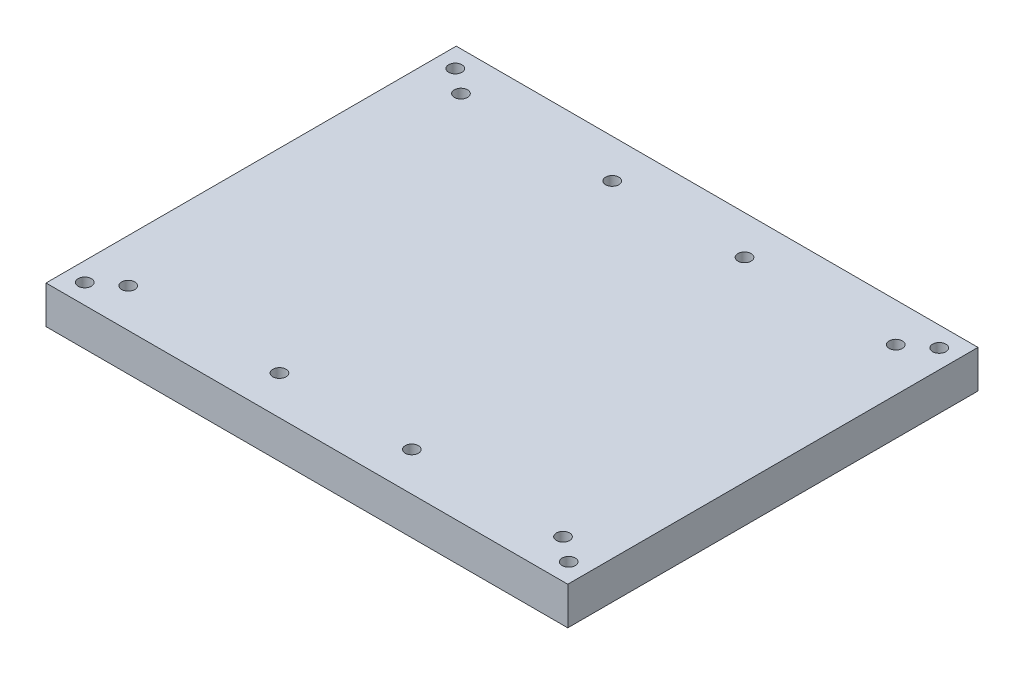
ISO-10303-21;
HEADER;
FILE_DESCRIPTION(('STEP AP214'),'2;1');
FILE_NAME('part.step','',(''),(''),'','','');
FILE_SCHEMA(('AUTOMOTIVE_DESIGN { 1 0 10303 214 1 1 1 1 }'));
ENDSEC;
DATA;
#1=APPLICATION_CONTEXT('core data for automotive mechanical design processes');
#2=APPLICATION_PROTOCOL_DEFINITION('international standard','automotive_design',2000,#1);
#3=PRODUCT_CONTEXT('',#1,'mechanical');
#4=PRODUCT('Part','Part','',(#3));
#5=PRODUCT_RELATED_PRODUCT_CATEGORY('part','',(#4));
#6=PRODUCT_DEFINITION_FORMATION('','',#4);
#7=PRODUCT_DEFINITION_CONTEXT('part definition',#1,'design');
#8=PRODUCT_DEFINITION('design','',#6,#7);
#9=PRODUCT_DEFINITION_SHAPE('','',#8);
#10=(LENGTH_UNIT() NAMED_UNIT(*) SI_UNIT(.MILLI.,.METRE.));
#11=(NAMED_UNIT(*) PLANE_ANGLE_UNIT() SI_UNIT($,.RADIAN.));
#12=(NAMED_UNIT(*) SI_UNIT($,.STERADIAN.) SOLID_ANGLE_UNIT());
#13=UNCERTAINTY_MEASURE_WITH_UNIT(LENGTH_MEASURE(1.E-05),#10,'distance_accuracy_value','');
#14=(GEOMETRIC_REPRESENTATION_CONTEXT(3) GLOBAL_UNCERTAINTY_ASSIGNED_CONTEXT((#13)) GLOBAL_UNIT_ASSIGNED_CONTEXT((#10,
#11,#12)) REPRESENTATION_CONTEXT('',''));
#15=CARTESIAN_POINT('',(0.,0.,0.));
#16=DIRECTION('',(0.,0.,1.));
#17=DIRECTION('',(1.,0.,0.));
#18=AXIS2_PLACEMENT_3D('',#15,#16,#17);
#19=CARTESIAN_POINT('',(0.,10.,0.));
#20=DIRECTION('',(0.,1.,0.));
#21=DIRECTION('',(0.,0.,1.));
#22=AXIS2_PLACEMENT_3D('',#19,#20,#21);
#23=PLANE('',#22);
#24=CARTESIAN_POINT('',(57.5,10.,-44.));
#25=DIRECTION('',(0.,1.,0.));
#26=DIRECTION('',(0.,0.,1.));
#27=AXIS2_PLACEMENT_3D('',#24,#25,#26);
#28=CIRCLE('',#27,1.75);
#29=CARTESIAN_POINT('',(57.5,10.,-42.25));
#30=VERTEX_POINT('',#29);
#31=EDGE_CURVE('E169',#30,#30,#28,.T.);
#32=ORIENTED_EDGE('',*,*,#31,.F.);
#33=EDGE_LOOP('',(#32));
#34=FACE_BOUND('',#33,.T.);
#35=CARTESIAN_POINT('',(17.5,10.,44.));
#36=DIRECTION('',(0.,1.,0.));
#37=DIRECTION('',(0.,0.,1.));
#38=AXIS2_PLACEMENT_3D('',#35,#36,#37);
#39=CIRCLE('',#38,1.75);
#40=CARTESIAN_POINT('',(17.5,10.,45.75));
#41=VERTEX_POINT('',#40);
#42=EDGE_CURVE('E157',#41,#41,#39,.T.);
#43=ORIENTED_EDGE('',*,*,#42,.F.);
#44=EDGE_LOOP('',(#43));
#45=FACE_BOUND('',#44,.T.);
#46=CARTESIAN_POINT('',(-17.5,10.,44.));
#47=DIRECTION('',(0.,1.,0.));
#48=DIRECTION('',(0.,0.,1.));
#49=AXIS2_PLACEMENT_3D('',#46,#47,#48);
#50=CIRCLE('',#49,1.75);
#51=CARTESIAN_POINT('',(-17.5,10.,45.75));
#52=VERTEX_POINT('',#51);
#53=EDGE_CURVE('E145',#52,#52,#50,.T.);
#54=ORIENTED_EDGE('',*,*,#53,.F.);
#55=EDGE_LOOP('',(#54));
#56=FACE_BOUND('',#55,.T.);
#57=CARTESIAN_POINT('',(-57.5,10.,-44.));
#58=DIRECTION('',(0.,1.,0.));
#59=DIRECTION('',(0.,0.,1.));
#60=AXIS2_PLACEMENT_3D('',#57,#58,#59);
#61=CIRCLE('',#60,1.75);
#62=CARTESIAN_POINT('',(-57.5,10.,-42.25));
#63=VERTEX_POINT('',#62);
#64=EDGE_CURVE('E133',#63,#63,#61,.T.);
#65=ORIENTED_EDGE('',*,*,#64,.F.);
#66=EDGE_LOOP('',(#65));
#67=FACE_BOUND('',#66,.T.);
#68=CARTESIAN_POINT('',(64.,10.,49.));
#69=DIRECTION('',(0.,1.,0.));
#70=DIRECTION('',(0.,0.,1.));
#71=AXIS2_PLACEMENT_3D('',#68,#69,#70);
#72=CIRCLE('',#71,1.75);
#73=CARTESIAN_POINT('',(64.,10.,50.75));
#74=VERTEX_POINT('',#73);
#75=EDGE_CURVE('E121',#74,#74,#72,.T.);
#76=ORIENTED_EDGE('',*,*,#75,.F.);
#77=EDGE_LOOP('',(#76));
#78=FACE_BOUND('',#77,.T.);
#79=CARTESIAN_POINT('',(-64.,10.,-49.));
#80=DIRECTION('',(0.,1.,0.));
#81=DIRECTION('',(0.,0.,1.));
#82=AXIS2_PLACEMENT_3D('',#79,#80,#81);
#83=CIRCLE('',#82,1.75);
#84=CARTESIAN_POINT('',(-64.,10.,-47.25));
#85=VERTEX_POINT('',#84);
#86=EDGE_CURVE('E100',#85,#85,#83,.T.);
#87=ORIENTED_EDGE('',*,*,#86,.F.);
#88=EDGE_LOOP('',(#87));
#89=FACE_BOUND('',#88,.T.);
#90=DIRECTION('',(0.,0.,1.));
#91=VECTOR('',#90,1.);
#92=CARTESIAN_POINT('',(-69.,10.,54.25));
#93=LINE('',#92,#91);
#94=CARTESIAN_POINT('',(-69.,10.,-54.25));
#95=VERTEX_POINT('',#94);
#96=CARTESIAN_POINT('',(-69.,10.,54.25));
#97=VERTEX_POINT('',#96);
#98=EDGE_CURVE('E85',#95,#97,#93,.T.);
#99=ORIENTED_EDGE('',*,*,#98,.T.);
#100=DIRECTION('',(1.,0.,0.));
#101=VECTOR('',#100,1.);
#102=CARTESIAN_POINT('',(69.,10.,54.25));
#103=LINE('',#102,#101);
#104=CARTESIAN_POINT('',(69.,10.,54.25));
#105=VERTEX_POINT('',#104);
#106=EDGE_CURVE('E80',#97,#105,#103,.T.);
#107=ORIENTED_EDGE('',*,*,#106,.T.);
#108=DIRECTION('',(0.,0.,-1.));
#109=VECTOR('',#108,1.);
#110=CARTESIAN_POINT('',(69.,10.,54.25));
#111=LINE('',#110,#109);
#112=CARTESIAN_POINT('',(69.,10.,-54.25));
#113=VERTEX_POINT('',#112);
#114=EDGE_CURVE('E83',#105,#113,#111,.T.);
#115=ORIENTED_EDGE('',*,*,#114,.T.);
#116=DIRECTION('',(-1.,0.,0.));
#117=VECTOR('',#116,1.);
#118=CARTESIAN_POINT('',(69.,10.,-54.25));
#119=LINE('',#118,#117);
#120=EDGE_CURVE('E50',#113,#95,#119,.T.);
#121=ORIENTED_EDGE('',*,*,#120,.T.);
#122=EDGE_LOOP('',(#99,#107,#115,#121));
#123=FACE_BOUND('',#122,.T.);
#124=CARTESIAN_POINT('',(-64.,10.,49.));
#125=DIRECTION('',(0.,1.,0.));
#126=DIRECTION('',(0.,0.,1.));
#127=AXIS2_PLACEMENT_3D('',#124,#125,#126);
#128=CIRCLE('',#127,1.75);
#129=CARTESIAN_POINT('',(-64.,10.,50.75));
#130=VERTEX_POINT('',#129);
#131=EDGE_CURVE('E115',#130,#130,#128,.T.);
#132=ORIENTED_EDGE('',*,*,#131,.F.);
#133=EDGE_LOOP('',(#132));
#134=FACE_BOUND('',#133,.T.);
#135=CARTESIAN_POINT('',(64.,10.,-49.));
#136=DIRECTION('',(0.,1.,0.));
#137=DIRECTION('',(0.,0.,1.));
#138=AXIS2_PLACEMENT_3D('',#135,#136,#137);
#139=CIRCLE('',#138,1.75);
#140=CARTESIAN_POINT('',(64.,10.,-47.25));
#141=VERTEX_POINT('',#140);
#142=EDGE_CURVE('E127',#141,#141,#139,.T.);
#143=ORIENTED_EDGE('',*,*,#142,.F.);
#144=EDGE_LOOP('',(#143));
#145=FACE_BOUND('',#144,.T.);
#146=CARTESIAN_POINT('',(-17.5,10.,-44.));
#147=DIRECTION('',(0.,1.,0.));
#148=DIRECTION('',(0.,0.,1.));
#149=AXIS2_PLACEMENT_3D('',#146,#147,#148);
#150=CIRCLE('',#149,1.75);
#151=CARTESIAN_POINT('',(-17.5,10.,-42.25));
#152=VERTEX_POINT('',#151);
#153=EDGE_CURVE('E139',#152,#152,#150,.T.);
#154=ORIENTED_EDGE('',*,*,#153,.F.);
#155=EDGE_LOOP('',(#154));
#156=FACE_BOUND('',#155,.T.);
#157=CARTESIAN_POINT('',(-57.5,10.,44.));
#158=DIRECTION('',(0.,1.,0.));
#159=DIRECTION('',(0.,0.,1.));
#160=AXIS2_PLACEMENT_3D('',#157,#158,#159);
#161=CIRCLE('',#160,1.75);
#162=CARTESIAN_POINT('',(-57.5,10.,45.75));
#163=VERTEX_POINT('',#162);
#164=EDGE_CURVE('E151',#163,#163,#161,.T.);
#165=ORIENTED_EDGE('',*,*,#164,.F.);
#166=EDGE_LOOP('',(#165));
#167=FACE_BOUND('',#166,.T.);
#168=CARTESIAN_POINT('',(57.5,10.,44.));
#169=DIRECTION('',(0.,1.,0.));
#170=DIRECTION('',(0.,0.,1.));
#171=AXIS2_PLACEMENT_3D('',#168,#169,#170);
#172=CIRCLE('',#171,1.75);
#173=CARTESIAN_POINT('',(57.5,10.,45.75));
#174=VERTEX_POINT('',#173);
#175=EDGE_CURVE('E163',#174,#174,#172,.T.);
#176=ORIENTED_EDGE('',*,*,#175,.F.);
#177=EDGE_LOOP('',(#176));
#178=FACE_BOUND('',#177,.T.);
#179=CARTESIAN_POINT('',(17.5,10.,-44.));
#180=DIRECTION('',(0.,1.,0.));
#181=DIRECTION('',(0.,0.,1.));
#182=AXIS2_PLACEMENT_3D('',#179,#180,#181);
#183=CIRCLE('',#182,1.75);
#184=CARTESIAN_POINT('',(17.5,10.,-42.25));
#185=VERTEX_POINT('',#184);
#186=EDGE_CURVE('E175',#185,#185,#183,.T.);
#187=ORIENTED_EDGE('',*,*,#186,.F.);
#188=EDGE_LOOP('',(#187));
#189=FACE_BOUND('',#188,.T.);
#190=ADVANCED_FACE('F33',(#34,#45,#56,#67,#78,#89,#123,#134,#145,#156,#167,#178,#189),#23,.T.);
#191=CARTESIAN_POINT('',(0.,0.,0.));
#192=DIRECTION('',(0.,1.,0.));
#193=DIRECTION('',(0.,0.,1.));
#194=AXIS2_PLACEMENT_3D('',#191,#192,#193);
#195=PLANE('',#194);
#196=CARTESIAN_POINT('',(57.5,0.,-44.));
#197=DIRECTION('',(0.,1.,0.));
#198=DIRECTION('',(0.,0.,1.));
#199=AXIS2_PLACEMENT_3D('',#196,#197,#198);
#200=CIRCLE('',#199,1.75);
#201=CARTESIAN_POINT('',(57.5,0.,-42.25));
#202=VERTEX_POINT('',#201);
#203=EDGE_CURVE('E172',#202,#202,#200,.T.);
#204=ORIENTED_EDGE('',*,*,#203,.T.);
#205=EDGE_LOOP('',(#204));
#206=FACE_BOUND('',#205,.T.);
#207=CARTESIAN_POINT('',(17.5,0.,44.));
#208=DIRECTION('',(0.,1.,0.));
#209=DIRECTION('',(0.,0.,1.));
#210=AXIS2_PLACEMENT_3D('',#207,#208,#209);
#211=CIRCLE('',#210,1.75);
#212=CARTESIAN_POINT('',(17.5,0.,45.75));
#213=VERTEX_POINT('',#212);
#214=EDGE_CURVE('E160',#213,#213,#211,.T.);
#215=ORIENTED_EDGE('',*,*,#214,.T.);
#216=EDGE_LOOP('',(#215));
#217=FACE_BOUND('',#216,.T.);
#218=CARTESIAN_POINT('',(-17.5,0.,44.));
#219=DIRECTION('',(0.,1.,0.));
#220=DIRECTION('',(0.,0.,1.));
#221=AXIS2_PLACEMENT_3D('',#218,#219,#220);
#222=CIRCLE('',#221,1.75);
#223=CARTESIAN_POINT('',(-17.5,0.,45.75));
#224=VERTEX_POINT('',#223);
#225=EDGE_CURVE('E148',#224,#224,#222,.T.);
#226=ORIENTED_EDGE('',*,*,#225,.T.);
#227=EDGE_LOOP('',(#226));
#228=FACE_BOUND('',#227,.T.);
#229=CARTESIAN_POINT('',(-57.5,0.,-44.));
#230=DIRECTION('',(0.,1.,0.));
#231=DIRECTION('',(0.,0.,1.));
#232=AXIS2_PLACEMENT_3D('',#229,#230,#231);
#233=CIRCLE('',#232,1.75);
#234=CARTESIAN_POINT('',(-57.5,0.,-42.25));
#235=VERTEX_POINT('',#234);
#236=EDGE_CURVE('E136',#235,#235,#233,.T.);
#237=ORIENTED_EDGE('',*,*,#236,.T.);
#238=EDGE_LOOP('',(#237));
#239=FACE_BOUND('',#238,.T.);
#240=CARTESIAN_POINT('',(64.,0.,49.));
#241=DIRECTION('',(0.,1.,0.));
#242=DIRECTION('',(0.,0.,1.));
#243=AXIS2_PLACEMENT_3D('',#240,#241,#242);
#244=CIRCLE('',#243,1.75);
#245=CARTESIAN_POINT('',(64.,0.,50.75));
#246=VERTEX_POINT('',#245);
#247=EDGE_CURVE('E124',#246,#246,#244,.T.);
#248=ORIENTED_EDGE('',*,*,#247,.T.);
#249=EDGE_LOOP('',(#248));
#250=FACE_BOUND('',#249,.T.);
#251=CARTESIAN_POINT('',(-64.,0.,-49.));
#252=DIRECTION('',(0.,1.,0.));
#253=DIRECTION('',(0.,0.,1.));
#254=AXIS2_PLACEMENT_3D('',#251,#252,#253);
#255=CIRCLE('',#254,1.75);
#256=CARTESIAN_POINT('',(-64.,0.,-47.25));
#257=VERTEX_POINT('',#256);
#258=EDGE_CURVE('E112',#257,#257,#255,.T.);
#259=ORIENTED_EDGE('',*,*,#258,.T.);
#260=EDGE_LOOP('',(#259));
#261=FACE_BOUND('',#260,.T.);
#262=DIRECTION('',(0.,0.,1.));
#263=VECTOR('',#262,1.);
#264=CARTESIAN_POINT('',(-69.,0.,54.25));
#265=LINE('',#264,#263);
#266=CARTESIAN_POINT('',(-69.,0.,-54.25));
#267=VERTEX_POINT('',#266);
#268=CARTESIAN_POINT('',(-69.,0.,54.25));
#269=VERTEX_POINT('',#268);
#270=EDGE_CURVE('E97',#267,#269,#265,.T.);
#271=ORIENTED_EDGE('',*,*,#270,.F.);
#272=DIRECTION('',(-1.,0.,0.));
#273=VECTOR('',#272,1.);
#274=CARTESIAN_POINT('',(69.,0.,-54.25));
#275=LINE('',#274,#273);
#276=CARTESIAN_POINT('',(69.,0.,-54.25));
#277=VERTEX_POINT('',#276);
#278=EDGE_CURVE('E73',#277,#267,#275,.T.);
#279=ORIENTED_EDGE('',*,*,#278,.F.);
#280=DIRECTION('',(0.,0.,-1.));
#281=VECTOR('',#280,1.);
#282=CARTESIAN_POINT('',(69.,0.,54.25));
#283=LINE('',#282,#281);
#284=CARTESIAN_POINT('',(69.,0.,54.25));
#285=VERTEX_POINT('',#284);
#286=EDGE_CURVE('E67',#285,#277,#283,.T.);
#287=ORIENTED_EDGE('',*,*,#286,.F.);
#288=DIRECTION('',(1.,0.,0.));
#289=VECTOR('',#288,1.);
#290=CARTESIAN_POINT('',(69.,0.,54.25));
#291=LINE('',#290,#289);
#292=EDGE_CURVE('E89',#269,#285,#291,.T.);
#293=ORIENTED_EDGE('',*,*,#292,.F.);
#294=EDGE_LOOP('',(#271,#279,#287,#293));
#295=FACE_BOUND('',#294,.T.);
#296=CARTESIAN_POINT('',(-64.,0.,49.));
#297=DIRECTION('',(0.,1.,0.));
#298=DIRECTION('',(0.,0.,1.));
#299=AXIS2_PLACEMENT_3D('',#296,#297,#298);
#300=CIRCLE('',#299,1.75);
#301=CARTESIAN_POINT('',(-64.,0.,50.75));
#302=VERTEX_POINT('',#301);
#303=EDGE_CURVE('E118',#302,#302,#300,.T.);
#304=ORIENTED_EDGE('',*,*,#303,.T.);
#305=EDGE_LOOP('',(#304));
#306=FACE_BOUND('',#305,.T.);
#307=CARTESIAN_POINT('',(64.,0.,-49.));
#308=DIRECTION('',(0.,1.,0.));
#309=DIRECTION('',(0.,0.,1.));
#310=AXIS2_PLACEMENT_3D('',#307,#308,#309);
#311=CIRCLE('',#310,1.75);
#312=CARTESIAN_POINT('',(64.,0.,-47.25));
#313=VERTEX_POINT('',#312);
#314=EDGE_CURVE('E130',#313,#313,#311,.T.);
#315=ORIENTED_EDGE('',*,*,#314,.T.);
#316=EDGE_LOOP('',(#315));
#317=FACE_BOUND('',#316,.T.);
#318=CARTESIAN_POINT('',(-17.5,0.,-44.));
#319=DIRECTION('',(0.,1.,0.));
#320=DIRECTION('',(0.,0.,1.));
#321=AXIS2_PLACEMENT_3D('',#318,#319,#320);
#322=CIRCLE('',#321,1.75);
#323=CARTESIAN_POINT('',(-17.5,0.,-42.25));
#324=VERTEX_POINT('',#323);
#325=EDGE_CURVE('E142',#324,#324,#322,.T.);
#326=ORIENTED_EDGE('',*,*,#325,.T.);
#327=EDGE_LOOP('',(#326));
#328=FACE_BOUND('',#327,.T.);
#329=CARTESIAN_POINT('',(-57.5,0.,44.));
#330=DIRECTION('',(0.,1.,0.));
#331=DIRECTION('',(0.,0.,1.));
#332=AXIS2_PLACEMENT_3D('',#329,#330,#331);
#333=CIRCLE('',#332,1.75);
#334=CARTESIAN_POINT('',(-57.5,0.,45.75));
#335=VERTEX_POINT('',#334);
#336=EDGE_CURVE('E154',#335,#335,#333,.T.);
#337=ORIENTED_EDGE('',*,*,#336,.T.);
#338=EDGE_LOOP('',(#337));
#339=FACE_BOUND('',#338,.T.);
#340=CARTESIAN_POINT('',(57.5,0.,44.));
#341=DIRECTION('',(0.,1.,0.));
#342=DIRECTION('',(0.,0.,1.));
#343=AXIS2_PLACEMENT_3D('',#340,#341,#342);
#344=CIRCLE('',#343,1.75);
#345=CARTESIAN_POINT('',(57.5,0.,45.75));
#346=VERTEX_POINT('',#345);
#347=EDGE_CURVE('E166',#346,#346,#344,.T.);
#348=ORIENTED_EDGE('',*,*,#347,.T.);
#349=EDGE_LOOP('',(#348));
#350=FACE_BOUND('',#349,.T.);
#351=CARTESIAN_POINT('',(17.5,0.,-44.));
#352=DIRECTION('',(0.,1.,0.));
#353=DIRECTION('',(0.,0.,1.));
#354=AXIS2_PLACEMENT_3D('',#351,#352,#353);
#355=CIRCLE('',#354,1.75);
#356=CARTESIAN_POINT('',(17.5,0.,-42.25));
#357=VERTEX_POINT('',#356);
#358=EDGE_CURVE('E178',#357,#357,#355,.T.);
#359=ORIENTED_EDGE('',*,*,#358,.T.);
#360=EDGE_LOOP('',(#359));
#361=FACE_BOUND('',#360,.T.);
#362=ADVANCED_FACE('F108',(#206,#217,#228,#239,#250,#261,#295,#306,#317,#328,#339,#350,#361),
#195,.F.);
#363=CARTESIAN_POINT('',(-69.,10.,54.25));
#364=DIRECTION('',(1.,0.,0.));
#365=DIRECTION('',(0.,0.,-1.));
#366=AXIS2_PLACEMENT_3D('',#363,#364,#365);
#367=PLANE('',#366);
#368=ORIENTED_EDGE('',*,*,#270,.T.);
#369=DIRECTION('',(0.,-1.,0.));
#370=VECTOR('',#369,1.);
#371=CARTESIAN_POINT('',(-69.,10.,54.25));
#372=LINE('',#371,#370);
#373=EDGE_CURVE('E11',#97,#269,#372,.T.);
#374=ORIENTED_EDGE('',*,*,#373,.F.);
#375=ORIENTED_EDGE('',*,*,#98,.F.);
#376=DIRECTION('',(0.,-1.,0.));
#377=VECTOR('',#376,1.);
#378=CARTESIAN_POINT('',(-69.,10.,-54.25));
#379=LINE('',#378,#377);
#380=EDGE_CURVE('E93',#95,#267,#379,.T.);
#381=ORIENTED_EDGE('',*,*,#380,.T.);
#382=EDGE_LOOP('',(#368,#374,#375,#381));
#383=FACE_BOUND('',#382,.T.);
#384=ADVANCED_FACE('F35',(#383),#367,.F.);
#385=CARTESIAN_POINT('',(69.,10.,54.25));
#386=DIRECTION('',(0.,0.,-1.));
#387=DIRECTION('',(-1.,0.,0.));
#388=AXIS2_PLACEMENT_3D('',#385,#386,#387);
#389=PLANE('',#388);
#390=ORIENTED_EDGE('',*,*,#292,.T.);
#391=DIRECTION('',(0.,-1.,0.));
#392=VECTOR('',#391,1.);
#393=CARTESIAN_POINT('',(69.,10.,54.25));
#394=LINE('',#393,#392);
#395=EDGE_CURVE('E42',#105,#285,#394,.T.);
#396=ORIENTED_EDGE('',*,*,#395,.F.);
#397=ORIENTED_EDGE('',*,*,#106,.F.);
#398=ORIENTED_EDGE('',*,*,#373,.T.);
#399=EDGE_LOOP('',(#390,#396,#397,#398));
#400=FACE_BOUND('',#399,.T.);
#401=ADVANCED_FACE('F88',(#400),#389,.F.);
#402=CARTESIAN_POINT('',(69.,10.,54.25));
#403=DIRECTION('',(-1.,0.,0.));
#404=DIRECTION('',(0.,0.,1.));
#405=AXIS2_PLACEMENT_3D('',#402,#403,#404);
#406=PLANE('',#405);
#407=ORIENTED_EDGE('',*,*,#286,.T.);
#408=DIRECTION('',(0.,-1.,0.));
#409=VECTOR('',#408,1.);
#410=CARTESIAN_POINT('',(69.,10.,-54.25));
#411=LINE('',#410,#409);
#412=EDGE_CURVE('E90',#113,#277,#411,.T.);
#413=ORIENTED_EDGE('',*,*,#412,.F.);
#414=ORIENTED_EDGE('',*,*,#114,.F.);
#415=ORIENTED_EDGE('',*,*,#395,.T.);
#416=EDGE_LOOP('',(#407,#413,#414,#415));
#417=FACE_BOUND('',#416,.T.);
#418=ADVANCED_FACE('F91',(#417),#406,.F.);
#419=CARTESIAN_POINT('',(69.,10.,-54.25));
#420=DIRECTION('',(0.,0.,1.));
#421=DIRECTION('',(1.,0.,0.));
#422=AXIS2_PLACEMENT_3D('',#419,#420,#421);
#423=PLANE('',#422);
#424=ORIENTED_EDGE('',*,*,#278,.T.);
#425=ORIENTED_EDGE('',*,*,#380,.F.);
#426=ORIENTED_EDGE('',*,*,#120,.F.);
#427=ORIENTED_EDGE('',*,*,#412,.T.);
#428=EDGE_LOOP('',(#424,#425,#426,#427));
#429=FACE_BOUND('',#428,.T.);
#430=ADVANCED_FACE('F105',(#429),#423,.F.);
#431=CARTESIAN_POINT('',(-64.,10.,-49.));
#432=DIRECTION('',(0.,-1.,0.));
#433=DIRECTION('',(0.,0.,-1.));
#434=AXIS2_PLACEMENT_3D('',#431,#432,#433);
#435=CYLINDRICAL_SURFACE('',#434,1.75);
#436=ORIENTED_EDGE('',*,*,#86,.T.);
#437=EDGE_LOOP('',(#436));
#438=FACE_BOUND('',#437,.T.);
#439=ORIENTED_EDGE('',*,*,#258,.F.);
#440=EDGE_LOOP('',(#439));
#441=FACE_BOUND('',#440,.T.);
#442=ADVANCED_FACE('F198',(#438,#441),#435,.F.);
#443=CARTESIAN_POINT('',(-64.,10.,49.));
#444=DIRECTION('',(0.,-1.,0.));
#445=DIRECTION('',(0.,0.,-1.));
#446=AXIS2_PLACEMENT_3D('',#443,#444,#445);
#447=CYLINDRICAL_SURFACE('',#446,1.75);
#448=ORIENTED_EDGE('',*,*,#131,.T.);
#449=EDGE_LOOP('',(#448));
#450=FACE_BOUND('',#449,.T.);
#451=ORIENTED_EDGE('',*,*,#303,.F.);
#452=EDGE_LOOP('',(#451));
#453=FACE_BOUND('',#452,.T.);
#454=ADVANCED_FACE('F244',(#450,#453),#447,.F.);
#455=CARTESIAN_POINT('',(64.,10.,49.));
#456=DIRECTION('',(0.,-1.,0.));
#457=DIRECTION('',(0.,0.,-1.));
#458=AXIS2_PLACEMENT_3D('',#455,#456,#457);
#459=CYLINDRICAL_SURFACE('',#458,1.75);
#460=ORIENTED_EDGE('',*,*,#75,.T.);
#461=EDGE_LOOP('',(#460));
#462=FACE_BOUND('',#461,.T.);
#463=ORIENTED_EDGE('',*,*,#247,.F.);
#464=EDGE_LOOP('',(#463));
#465=FACE_BOUND('',#464,.T.);
#466=ADVANCED_FACE('F252',(#462,#465),#459,.F.);
#467=CARTESIAN_POINT('',(64.,10.,-49.));
#468=DIRECTION('',(0.,-1.,0.));
#469=DIRECTION('',(0.,0.,-1.));
#470=AXIS2_PLACEMENT_3D('',#467,#468,#469);
#471=CYLINDRICAL_SURFACE('',#470,1.75);
#472=ORIENTED_EDGE('',*,*,#142,.T.);
#473=EDGE_LOOP('',(#472));
#474=FACE_BOUND('',#473,.T.);
#475=ORIENTED_EDGE('',*,*,#314,.F.);
#476=EDGE_LOOP('',(#475));
#477=FACE_BOUND('',#476,.T.);
#478=ADVANCED_FACE('F260',(#474,#477),#471,.F.);
#479=CARTESIAN_POINT('',(-57.5,10.,-44.));
#480=DIRECTION('',(0.,-1.,0.));
#481=DIRECTION('',(0.,0.,-1.));
#482=AXIS2_PLACEMENT_3D('',#479,#480,#481);
#483=CYLINDRICAL_SURFACE('',#482,1.75);
#484=ORIENTED_EDGE('',*,*,#64,.T.);
#485=EDGE_LOOP('',(#484));
#486=FACE_BOUND('',#485,.T.);
#487=ORIENTED_EDGE('',*,*,#236,.F.);
#488=EDGE_LOOP('',(#487));
#489=FACE_BOUND('',#488,.T.);
#490=ADVANCED_FACE('F269',(#486,#489),#483,.F.);
#491=CARTESIAN_POINT('',(-17.5,10.,-44.));
#492=DIRECTION('',(0.,-1.,0.));
#493=DIRECTION('',(0.,0.,-1.));
#494=AXIS2_PLACEMENT_3D('',#491,#492,#493);
#495=CYLINDRICAL_SURFACE('',#494,1.75);
#496=ORIENTED_EDGE('',*,*,#153,.T.);
#497=EDGE_LOOP('',(#496));
#498=FACE_BOUND('',#497,.T.);
#499=ORIENTED_EDGE('',*,*,#325,.F.);
#500=EDGE_LOOP('',(#499));
#501=FACE_BOUND('',#500,.T.);
#502=ADVANCED_FACE('F278',(#498,#501),#495,.F.);
#503=CARTESIAN_POINT('',(-17.5,10.,44.));
#504=DIRECTION('',(0.,-1.,0.));
#505=DIRECTION('',(0.,0.,-1.));
#506=AXIS2_PLACEMENT_3D('',#503,#504,#505);
#507=CYLINDRICAL_SURFACE('',#506,1.75);
#508=ORIENTED_EDGE('',*,*,#53,.T.);
#509=EDGE_LOOP('',(#508));
#510=FACE_BOUND('',#509,.T.);
#511=ORIENTED_EDGE('',*,*,#225,.F.);
#512=EDGE_LOOP('',(#511));
#513=FACE_BOUND('',#512,.T.);
#514=ADVANCED_FACE('F287',(#510,#513),#507,.F.);
#515=CARTESIAN_POINT('',(-57.5,10.,44.));
#516=DIRECTION('',(0.,-1.,0.));
#517=DIRECTION('',(0.,0.,-1.));
#518=AXIS2_PLACEMENT_3D('',#515,#516,#517);
#519=CYLINDRICAL_SURFACE('',#518,1.75);
#520=ORIENTED_EDGE('',*,*,#164,.T.);
#521=EDGE_LOOP('',(#520));
#522=FACE_BOUND('',#521,.T.);
#523=ORIENTED_EDGE('',*,*,#336,.F.);
#524=EDGE_LOOP('',(#523));
#525=FACE_BOUND('',#524,.T.);
#526=ADVANCED_FACE('F296',(#522,#525),#519,.F.);
#527=CARTESIAN_POINT('',(17.5,10.,44.));
#528=DIRECTION('',(0.,-1.,0.));
#529=DIRECTION('',(0.,0.,-1.));
#530=AXIS2_PLACEMENT_3D('',#527,#528,#529);
#531=CYLINDRICAL_SURFACE('',#530,1.75);
#532=ORIENTED_EDGE('',*,*,#42,.T.);
#533=EDGE_LOOP('',(#532));
#534=FACE_BOUND('',#533,.T.);
#535=ORIENTED_EDGE('',*,*,#214,.F.);
#536=EDGE_LOOP('',(#535));
#537=FACE_BOUND('',#536,.T.);
#538=ADVANCED_FACE('F305',(#534,#537),#531,.F.);
#539=CARTESIAN_POINT('',(57.5,10.,44.));
#540=DIRECTION('',(0.,-1.,0.));
#541=DIRECTION('',(0.,0.,-1.));
#542=AXIS2_PLACEMENT_3D('',#539,#540,#541);
#543=CYLINDRICAL_SURFACE('',#542,1.75);
#544=ORIENTED_EDGE('',*,*,#175,.T.);
#545=EDGE_LOOP('',(#544));
#546=FACE_BOUND('',#545,.T.);
#547=ORIENTED_EDGE('',*,*,#347,.F.);
#548=EDGE_LOOP('',(#547));
#549=FACE_BOUND('',#548,.T.);
#550=ADVANCED_FACE('F314',(#546,#549),#543,.F.);
#551=CARTESIAN_POINT('',(57.5,10.,-44.));
#552=DIRECTION('',(0.,-1.,0.));
#553=DIRECTION('',(0.,0.,-1.));
#554=AXIS2_PLACEMENT_3D('',#551,#552,#553);
#555=CYLINDRICAL_SURFACE('',#554,1.75);
#556=ORIENTED_EDGE('',*,*,#31,.T.);
#557=EDGE_LOOP('',(#556));
#558=FACE_BOUND('',#557,.T.);
#559=ORIENTED_EDGE('',*,*,#203,.F.);
#560=EDGE_LOOP('',(#559));
#561=FACE_BOUND('',#560,.T.);
#562=ADVANCED_FACE('F323',(#558,#561),#555,.F.);
#563=CARTESIAN_POINT('',(17.5,10.,-44.));
#564=DIRECTION('',(0.,-1.,0.));
#565=DIRECTION('',(0.,0.,-1.));
#566=AXIS2_PLACEMENT_3D('',#563,#564,#565);
#567=CYLINDRICAL_SURFACE('',#566,1.75);
#568=ORIENTED_EDGE('',*,*,#186,.T.);
#569=EDGE_LOOP('',(#568));
#570=FACE_BOUND('',#569,.T.);
#571=ORIENTED_EDGE('',*,*,#358,.F.);
#572=EDGE_LOOP('',(#571));
#573=FACE_BOUND('',#572,.T.);
#574=ADVANCED_FACE('F184',(#570,#573),#567,.F.);
#575=CLOSED_SHELL('',(#190,#362,#384,#401,#418,#430,#442,#454,#466,#478,#490,#502,#514,#526,
#538,#550,#562,#574));
#576=MANIFOLD_SOLID_BREP('B2',#575);
#577=ADVANCED_BREP_SHAPE_REPRESENTATION('',(#18,#576),#14);
#578=SHAPE_DEFINITION_REPRESENTATION(#9,#577);
ENDSEC;
END-ISO-10303-21;
